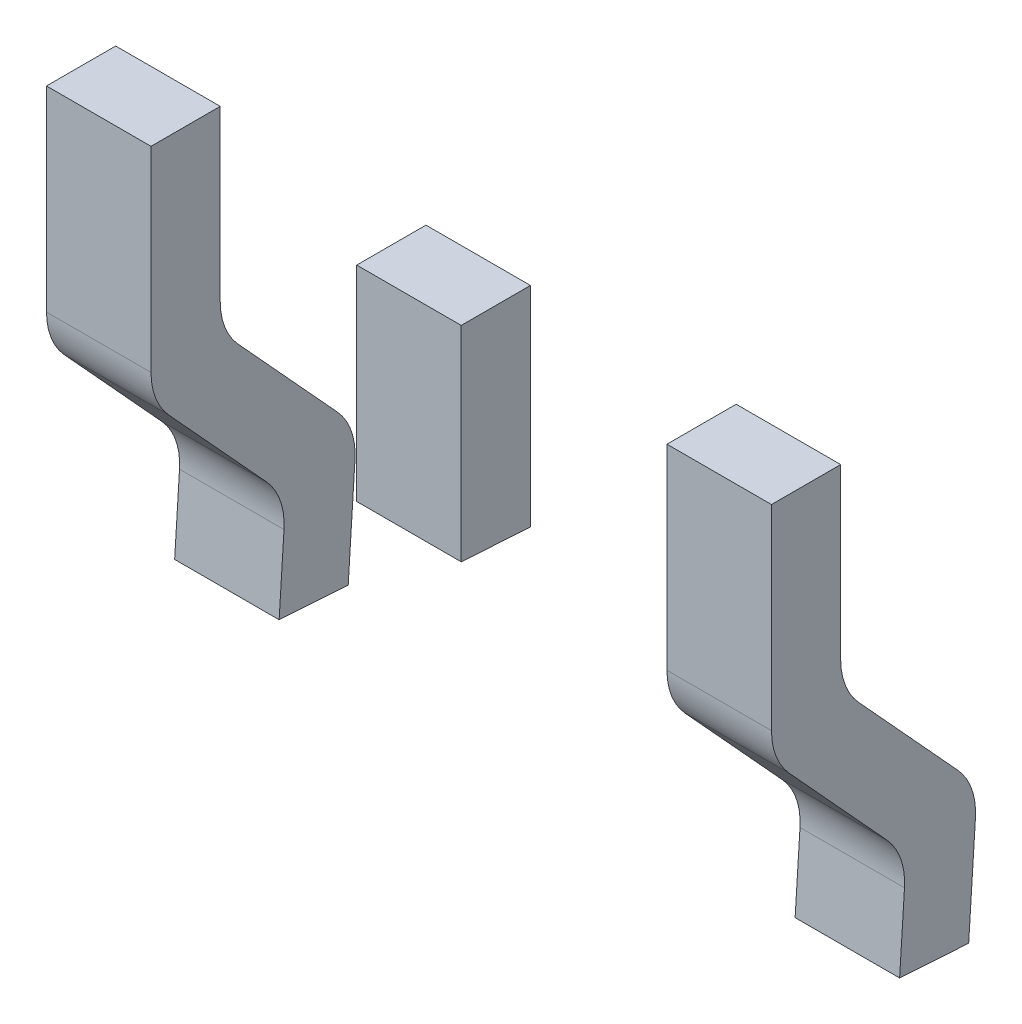
ISO-10303-21;
HEADER;
FILE_DESCRIPTION(('STEP AP214'),'2;1');
FILE_NAME('part.step','',(''),(''),'','','');
FILE_SCHEMA(('AUTOMOTIVE_DESIGN { 1 0 10303 214 1 1 1 1 }'));
ENDSEC;
DATA;
#1=APPLICATION_CONTEXT('core data for automotive mechanical design processes');
#2=APPLICATION_PROTOCOL_DEFINITION('international standard','automotive_design',2000,#1);
#3=PRODUCT_CONTEXT('',#1,'mechanical');
#4=PRODUCT('Part','Part','',(#3));
#5=PRODUCT_RELATED_PRODUCT_CATEGORY('part','',(#4));
#6=PRODUCT_DEFINITION_FORMATION('','',#4);
#7=PRODUCT_DEFINITION_CONTEXT('part definition',#1,'design');
#8=PRODUCT_DEFINITION('design','',#6,#7);
#9=PRODUCT_DEFINITION_SHAPE('','',#8);
#10=(LENGTH_UNIT() NAMED_UNIT(*) SI_UNIT(.MILLI.,.METRE.));
#11=(NAMED_UNIT(*) PLANE_ANGLE_UNIT() SI_UNIT($,.RADIAN.));
#12=(NAMED_UNIT(*) SI_UNIT($,.STERADIAN.) SOLID_ANGLE_UNIT());
#13=UNCERTAINTY_MEASURE_WITH_UNIT(LENGTH_MEASURE(1.E-05),#10,'distance_accuracy_value','');
#14=(GEOMETRIC_REPRESENTATION_CONTEXT(3) GLOBAL_UNCERTAINTY_ASSIGNED_CONTEXT((#13)) GLOBAL_UNIT_ASSIGNED_CONTEXT((#10,
#11,#12)) REPRESENTATION_CONTEXT('',''));
#15=CARTESIAN_POINT('',(0.,0.,0.));
#16=DIRECTION('',(0.,0.,1.));
#17=DIRECTION('',(1.,0.,0.));
#18=AXIS2_PLACEMENT_3D('',#15,#16,#17);
#19=CARTESIAN_POINT('',(-2.286,-3.883125111,1.02));
#20=DIRECTION('',(-1.,0.,0.));
#21=DIRECTION('',(0.,0.,-1.));
#22=AXIS2_PLACEMENT_3D('',#19,#20,#21);
#23=CYLINDRICAL_SURFACE('',#22,0.5);
#24=CARTESIAN_POINT('',(-1.901,-3.883125111,1.02));
#25=DIRECTION('',(-1.,0.,0.));
#26=DIRECTION('',(0.,0.,1.));
#27=AXIS2_PLACEMENT_3D('',#24,#25,#26);
#28=CIRCLE('',#27,0.5);
#29=CARTESIAN_POINT('',(-1.901,-4.220707572,1.388833407));
#30=VERTEX_POINT('',#29);
#31=CARTESIAN_POINT('',(-1.901,-3.883125111,1.52));
#32=VERTEX_POINT('',#31);
#33=EDGE_CURVE('P0_E255',#30,#32,#28,.T.);
#34=ORIENTED_EDGE('',*,*,#33,.T.);
#35=DIRECTION('',(-1.,0.,0.));
#36=VECTOR('',#35,1.);
#37=CARTESIAN_POINT('',(-1.901,-3.883125111,1.52));
#38=LINE('',#37,#36);
#39=CARTESIAN_POINT('',(-2.671,-3.883125111,1.52));
#40=VERTEX_POINT('',#39);
#41=EDGE_CURVE('P0_E47',#32,#40,#38,.T.);
#42=ORIENTED_EDGE('',*,*,#41,.T.);
#43=CARTESIAN_POINT('',(-2.671,-3.883125111,1.02));
#44=DIRECTION('',(1.,0.,0.));
#45=DIRECTION('',(0.,0.,-1.));
#46=AXIS2_PLACEMENT_3D('',#43,#44,#45);
#47=CIRCLE('',#46,0.5);
#48=CARTESIAN_POINT('',(-2.671,-4.220707572,1.388833407));
#49=VERTEX_POINT('',#48);
#50=EDGE_CURVE('P0_E38',#40,#49,#47,.T.);
#51=ORIENTED_EDGE('',*,*,#50,.T.);
#52=DIRECTION('',(1.,0.,0.));
#53=VECTOR('',#52,1.);
#54=CARTESIAN_POINT('',(-2.671,-4.220707572,1.388833407));
#55=LINE('',#54,#53);
#56=EDGE_CURVE('P0_E231',#49,#30,#55,.T.);
#57=ORIENTED_EDGE('',*,*,#56,.T.);
#58=EDGE_LOOP('',(#34,#42,#51,#57));
#59=FACE_BOUND('',#58,.T.);
#60=ADVANCED_FACE('P0_F17',(#59),#23,.T.);
#61=CARTESIAN_POINT('',(-2.286,-5.159538622,0.515992473));
#62=DIRECTION('',(1.,0.,0.));
#63=DIRECTION('',(0.,0.,1.));
#64=AXIS2_PLACEMENT_3D('',#61,#62,#63);
#65=CYLINDRICAL_SURFACE('',#64,0.5);
#66=CARTESIAN_POINT('',(-2.671,-5.159538622,0.515992473));
#67=DIRECTION('',(1.,0.,0.));
#68=DIRECTION('',(0.,0.,-1.));
#69=AXIS2_PLACEMENT_3D('',#66,#67,#68);
#70=CIRCLE('',#69,0.5);
#71=CARTESIAN_POINT('',(-2.671,-5.19163139,0.017023481));
#72=VERTEX_POINT('',#71);
#73=CARTESIAN_POINT('',(-2.671,-4.821956161,0.147159065));
#74=VERTEX_POINT('',#73);
#75=EDGE_CURVE('P0_E11',#72,#74,#70,.T.);
#76=ORIENTED_EDGE('',*,*,#75,.T.);
#77=DIRECTION('',(1.,0.,0.));
#78=VECTOR('',#77,1.);
#79=CARTESIAN_POINT('',(-2.671,-4.821956161,0.147159065));
#80=LINE('',#79,#78);
#81=CARTESIAN_POINT('',(-1.901,-4.821956161,0.147159065));
#82=VERTEX_POINT('',#81);
#83=EDGE_CURVE('P0_E214',#74,#82,#80,.T.);
#84=ORIENTED_EDGE('',*,*,#83,.T.);
#85=CARTESIAN_POINT('',(-1.901,-5.159538622,0.515992473));
#86=DIRECTION('',(-1.,0.,0.));
#87=DIRECTION('',(0.,0.,1.));
#88=AXIS2_PLACEMENT_3D('',#85,#86,#87);
#89=CIRCLE('',#88,0.5);
#90=CARTESIAN_POINT('',(-1.901,-5.19163139,0.017023481));
#91=VERTEX_POINT('',#90);
#92=EDGE_CURVE('P0_E259',#82,#91,#89,.T.);
#93=ORIENTED_EDGE('',*,*,#92,.T.);
#94=DIRECTION('',(-1.,0.,0.));
#95=VECTOR('',#94,1.);
#96=CARTESIAN_POINT('',(-1.901,-5.19163139,0.017023481));
#97=LINE('',#96,#95);
#98=EDGE_CURVE('P0_E146',#91,#72,#97,.T.);
#99=ORIENTED_EDGE('',*,*,#98,.T.);
#100=EDGE_LOOP('',(#76,#84,#93,#99));
#101=FACE_BOUND('',#100,.T.);
#102=ADVANCED_FACE('P0_F412',(#101),#65,.T.);
#103=CARTESIAN_POINT('',(-2.286,-5.343610965,1.038885469));
#104=DIRECTION('',(1.,0.,0.));
#105=DIRECTION('',(0.,0.,1.));
#106=AXIS2_PLACEMENT_3D('',#103,#104,#105);
#107=CYLINDRICAL_SURFACE('',#106,0.5);
#108=CARTESIAN_POINT('',(-1.901,-5.343610965,1.038885469));
#109=DIRECTION('',(1.,0.,0.));
#110=DIRECTION('',(0.,0.,1.));
#111=AXIS2_PLACEMENT_3D('',#108,#109,#110);
#112=CIRCLE('',#111,0.5);
#113=CARTESIAN_POINT('',(-1.901,-5.375703733,0.539916478));
#114=VERTEX_POINT('',#113);
#115=CARTESIAN_POINT('',(-1.901,-5.006028504,0.670052062));
#116=VERTEX_POINT('',#115);
#117=EDGE_CURVE('P0_E261',#114,#116,#112,.T.);
#118=ORIENTED_EDGE('',*,*,#117,.T.);
#119=DIRECTION('',(-1.,0.,0.));
#120=VECTOR('',#119,1.);
#121=CARTESIAN_POINT('',(-1.901,-5.006028504,0.670052062));
#122=LINE('',#121,#120);
#123=CARTESIAN_POINT('',(-2.671,-5.006028504,0.670052062));
#124=VERTEX_POINT('',#123);
#125=EDGE_CURVE('P0_E175',#116,#124,#122,.T.);
#126=ORIENTED_EDGE('',*,*,#125,.T.);
#127=CARTESIAN_POINT('',(-2.671,-5.343610965,1.038885469));
#128=DIRECTION('',(-1.,0.,0.));
#129=DIRECTION('',(0.,0.,-1.));
#130=AXIS2_PLACEMENT_3D('',#127,#128,#129);
#131=CIRCLE('',#130,0.5);
#132=CARTESIAN_POINT('',(-2.671,-5.375703733,0.539916478));
#133=VERTEX_POINT('',#132);
#134=EDGE_CURVE('P0_E248',#124,#133,#131,.T.);
#135=ORIENTED_EDGE('',*,*,#134,.T.);
#136=DIRECTION('',(1.,0.,0.));
#137=VECTOR('',#136,1.);
#138=CARTESIAN_POINT('',(-2.671,-5.375703733,0.539916478));
#139=LINE('',#138,#137);
#140=EDGE_CURVE('P0_E207',#133,#114,#139,.T.);
#141=ORIENTED_EDGE('',*,*,#140,.T.);
#142=EDGE_LOOP('',(#118,#126,#135,#141));
#143=FACE_BOUND('',#142,.T.);
#144=ADVANCED_FACE('P0_F273',(#143),#107,.F.);
#145=CARTESIAN_POINT('',(-2.286,-3.684966231,0.51));
#146=DIRECTION('',(-1.,0.,0.));
#147=DIRECTION('',(0.,0.,-1.));
#148=AXIS2_PLACEMENT_3D('',#145,#146,#147);
#149=CYLINDRICAL_SURFACE('',#148,0.5);
#150=CARTESIAN_POINT('',(-2.671,-3.684966231,0.51));
#151=DIRECTION('',(-1.,0.,0.));
#152=DIRECTION('',(0.,0.,-1.));
#153=AXIS2_PLACEMENT_3D('',#150,#151,#152);
#154=CIRCLE('',#153,0.5);
#155=CARTESIAN_POINT('',(-2.671,-4.022548692,0.878833407));
#156=VERTEX_POINT('',#155);
#157=CARTESIAN_POINT('',(-2.671,-3.684966231,1.01));
#158=VERTEX_POINT('',#157);
#159=EDGE_CURVE('P0_E20',#156,#158,#154,.T.);
#160=ORIENTED_EDGE('',*,*,#159,.T.);
#161=DIRECTION('',(1.,0.,0.));
#162=VECTOR('',#161,1.);
#163=CARTESIAN_POINT('',(-2.671,-3.684966231,1.01));
#164=LINE('',#163,#162);
#165=CARTESIAN_POINT('',(-1.901,-3.684966231,1.01));
#166=VERTEX_POINT('',#165);
#167=EDGE_CURVE('P0_E186',#158,#166,#164,.T.);
#168=ORIENTED_EDGE('',*,*,#167,.T.);
#169=CARTESIAN_POINT('',(-1.901,-3.684966231,0.51));
#170=DIRECTION('',(1.,0.,0.));
#171=DIRECTION('',(0.,0.,1.));
#172=AXIS2_PLACEMENT_3D('',#169,#170,#171);
#173=CIRCLE('',#172,0.5);
#174=CARTESIAN_POINT('',(-1.901,-4.022548692,0.878833407));
#175=VERTEX_POINT('',#174);
#176=EDGE_CURVE('P0_E245',#166,#175,#173,.T.);
#177=ORIENTED_EDGE('',*,*,#176,.T.);
#178=DIRECTION('',(-1.,0.,0.));
#179=VECTOR('',#178,1.);
#180=CARTESIAN_POINT('',(-1.901,-4.022548692,0.878833407));
#181=LINE('',#180,#179);
#182=EDGE_CURVE('P0_E223',#175,#156,#181,.T.);
#183=ORIENTED_EDGE('',*,*,#182,.T.);
#184=EDGE_LOOP('',(#160,#168,#177,#183));
#185=FACE_BOUND('',#184,.T.);
#186=ADVANCED_FACE('P0_F476',(#185),#149,.F.);
#187=CARTESIAN_POINT('',(-2.671,-3.05,1.265));
#188=DIRECTION('',(-1.,0.,0.));
#189=DIRECTION('',(0.,0.,1.));
#190=AXIS2_PLACEMENT_3D('',#187,#188,#189);
#191=PLANE('',#190);
#192=DIRECTION('',(0.,-0.997937982459945,0.0641855370295765));
#193=VECTOR('',#192,1.);
#194=CARTESIAN_POINT('',(-2.671,-5.19163139,0.017023481));
#195=LINE('',#194,#193);
#196=CARTESIAN_POINT('',(-2.671,-5.966282297,0.066847604));
#197=VERTEX_POINT('',#196);
#198=EDGE_CURVE('P0_E135',#72,#197,#195,.T.);
#199=ORIENTED_EDGE('',*,*,#198,.T.);
#200=DIRECTION('',(0.,0.0641855370295765,0.997937982459945));
#201=VECTOR('',#200,1.);
#202=CARTESIAN_POINT('',(-2.671,-5.966282297,0.066847604));
#203=LINE('',#202,#201);
#204=CARTESIAN_POINT('',(-2.671,-5.933547673,0.575795975));
#205=VERTEX_POINT('',#204);
#206=EDGE_CURVE('P0_E140',#197,#205,#203,.T.);
#207=ORIENTED_EDGE('',*,*,#206,.T.);
#208=DIRECTION('',(0.,-0.997937982459945,0.0641855370295765));
#209=VECTOR('',#208,1.);
#210=CARTESIAN_POINT('',(-2.671,-5.375703733,0.539916478));
#211=LINE('',#210,#209);
#212=EDGE_CURVE('P0_E181',#133,#205,#211,.T.);
#213=ORIENTED_EDGE('',*,*,#212,.F.);
#214=ORIENTED_EDGE('',*,*,#134,.F.);
#215=DIRECTION('',(0.,-0.737666814814986,-0.675164920830987));
#216=VECTOR('',#215,1.);
#217=CARTESIAN_POINT('',(-2.671,-4.220707572,1.388833407));
#218=LINE('',#217,#216);
#219=EDGE_CURVE('P0_E235',#49,#124,#218,.T.);
#220=ORIENTED_EDGE('',*,*,#219,.F.);
#221=ORIENTED_EDGE('',*,*,#50,.F.);
#222=DIRECTION('',(0.,-1.,0.));
#223=VECTOR('',#222,1.);
#224=CARTESIAN_POINT('',(-2.671,-2.44,1.52));
#225=LINE('',#224,#223);
#226=CARTESIAN_POINT('',(-2.671,-2.44,1.52));
#227=VERTEX_POINT('',#226);
#228=EDGE_CURVE('P0_E256',#227,#40,#225,.T.);
#229=ORIENTED_EDGE('',*,*,#228,.F.);
#230=DIRECTION('',(0.,0.,1.));
#231=VECTOR('',#230,1.);
#232=CARTESIAN_POINT('',(-2.671,-2.44,1.01));
#233=LINE('',#232,#231);
#234=CARTESIAN_POINT('',(-2.671,-2.44,1.01));
#235=VERTEX_POINT('',#234);
#236=EDGE_CURVE('P0_E191',#235,#227,#233,.T.);
#237=ORIENTED_EDGE('',*,*,#236,.F.);
#238=DIRECTION('',(0.,-1.,0.));
#239=VECTOR('',#238,1.);
#240=CARTESIAN_POINT('',(-2.671,-2.44,1.01));
#241=LINE('',#240,#239);
#242=EDGE_CURVE('P0_E171',#235,#158,#241,.T.);
#243=ORIENTED_EDGE('',*,*,#242,.T.);
#244=ORIENTED_EDGE('',*,*,#159,.F.);
#245=DIRECTION('',(0.,-0.737666814814986,-0.675164920830987));
#246=VECTOR('',#245,1.);
#247=CARTESIAN_POINT('',(-2.671,-4.022548692,0.878833407));
#248=LINE('',#247,#246);
#249=EDGE_CURVE('P0_E220',#156,#74,#248,.T.);
#250=ORIENTED_EDGE('',*,*,#249,.T.);
#251=ORIENTED_EDGE('',*,*,#75,.F.);
#252=EDGE_LOOP('',(#199,#207,#213,#214,#220,#221,#229,#237,#243,#244,#250,#251));
#253=FACE_BOUND('',#252,.T.);
#254=ADVANCED_FACE('P0_F137',(#253),#191,.T.);
#255=CARTESIAN_POINT('',(-2.286,-3.05,1.52));
#256=DIRECTION('',(0.,0.,1.));
#257=DIRECTION('',(1.,0.,0.));
#258=AXIS2_PLACEMENT_3D('',#255,#256,#257);
#259=PLANE('',#258);
#260=DIRECTION('',(0.,-1.,0.));
#261=VECTOR('',#260,1.);
#262=CARTESIAN_POINT('',(-1.901,-2.44,1.52));
#263=LINE('',#262,#261);
#264=CARTESIAN_POINT('',(-1.901,-2.44,1.52));
#265=VERTEX_POINT('',#264);
#266=EDGE_CURVE('P0_E251',#265,#32,#263,.T.);
#267=ORIENTED_EDGE('',*,*,#266,.F.);
#268=DIRECTION('',(1.,0.,0.));
#269=VECTOR('',#268,1.);
#270=CARTESIAN_POINT('',(-2.671,-2.44,1.52));
#271=LINE('',#270,#269);
#272=EDGE_CURVE('P0_E195',#227,#265,#271,.T.);
#273=ORIENTED_EDGE('',*,*,#272,.F.);
#274=ORIENTED_EDGE('',*,*,#228,.T.);
#275=ORIENTED_EDGE('',*,*,#41,.F.);
#276=EDGE_LOOP('',(#267,#273,#274,#275));
#277=FACE_BOUND('',#276,.T.);
#278=ADVANCED_FACE('P0_F461',(#277),#259,.T.);
#279=CARTESIAN_POINT('',(-1.901,-3.05,1.265));
#280=DIRECTION('',(1.,0.,0.));
#281=DIRECTION('',(0.,1.,0.));
#282=AXIS2_PLACEMENT_3D('',#279,#280,#281);
#283=PLANE('',#282);
#284=DIRECTION('',(0.,-0.737666814814986,-0.675164920830987));
#285=VECTOR('',#284,1.);
#286=CARTESIAN_POINT('',(-1.901,-4.022548692,0.878833407));
#287=LINE('',#286,#285);
#288=EDGE_CURVE('P0_E204',#175,#82,#287,.T.);
#289=ORIENTED_EDGE('',*,*,#288,.F.);
#290=ORIENTED_EDGE('',*,*,#176,.F.);
#291=DIRECTION('',(0.,-1.,0.));
#292=VECTOR('',#291,1.);
#293=CARTESIAN_POINT('',(-1.901,-2.44,1.01));
#294=LINE('',#293,#292);
#295=CARTESIAN_POINT('',(-1.901,-2.44,1.01));
#296=VERTEX_POINT('',#295);
#297=EDGE_CURVE('P0_E174',#296,#166,#294,.T.);
#298=ORIENTED_EDGE('',*,*,#297,.F.);
#299=DIRECTION('',(0.,0.,-1.));
#300=VECTOR('',#299,1.);
#301=CARTESIAN_POINT('',(-1.901,-2.44,1.52));
#302=LINE('',#301,#300);
#303=EDGE_CURVE('P0_E182',#265,#296,#302,.T.);
#304=ORIENTED_EDGE('',*,*,#303,.F.);
#305=ORIENTED_EDGE('',*,*,#266,.T.);
#306=ORIENTED_EDGE('',*,*,#33,.F.);
#307=DIRECTION('',(0.,-0.737666814814986,-0.675164920830987));
#308=VECTOR('',#307,1.);
#309=CARTESIAN_POINT('',(-1.901,-4.220707572,1.388833407));
#310=LINE('',#309,#308);
#311=EDGE_CURVE('P0_E227',#30,#116,#310,.T.);
#312=ORIENTED_EDGE('',*,*,#311,.T.);
#313=ORIENTED_EDGE('',*,*,#117,.F.);
#314=DIRECTION('',(0.,-0.997937982459945,0.0641855370295765));
#315=VECTOR('',#314,1.);
#316=CARTESIAN_POINT('',(-1.901,-5.375703733,0.539916478));
#317=LINE('',#316,#315);
#318=CARTESIAN_POINT('',(-1.901,-5.933547673,0.575795975));
#319=VERTEX_POINT('',#318);
#320=EDGE_CURVE('P0_E170',#114,#319,#317,.T.);
#321=ORIENTED_EDGE('',*,*,#320,.T.);
#322=DIRECTION('',(0.,-0.0641855370295765,-0.997937982459945));
#323=VECTOR('',#322,1.);
#324=CARTESIAN_POINT('',(-1.901,-5.933547673,0.575795975));
#325=LINE('',#324,#323);
#326=CARTESIAN_POINT('',(-1.901,-5.966282297,0.066847604));
#327=VERTEX_POINT('',#326);
#328=EDGE_CURVE('P0_E157',#319,#327,#325,.T.);
#329=ORIENTED_EDGE('',*,*,#328,.T.);
#330=DIRECTION('',(0.,-0.997937982459945,0.0641855370295765));
#331=VECTOR('',#330,1.);
#332=CARTESIAN_POINT('',(-1.901,-5.19163139,0.017023481));
#333=LINE('',#332,#331);
#334=EDGE_CURVE('P0_E147',#91,#327,#333,.T.);
#335=ORIENTED_EDGE('',*,*,#334,.F.);
#336=ORIENTED_EDGE('',*,*,#92,.F.);
#337=EDGE_LOOP('',(#289,#290,#298,#304,#305,#306,#312,#313,#321,#329,#335,#336));
#338=FACE_BOUND('',#337,.T.);
#339=ADVANCED_FACE('P0_F452',(#338),#283,.T.);
#340=CARTESIAN_POINT('',(-2.286,-3.05,1.01));
#341=DIRECTION('',(0.,0.,-1.));
#342=DIRECTION('',(0.,-1.,0.));
#343=AXIS2_PLACEMENT_3D('',#340,#341,#342);
#344=PLANE('',#343);
#345=ORIENTED_EDGE('',*,*,#242,.F.);
#346=DIRECTION('',(-1.,0.,0.));
#347=VECTOR('',#346,1.);
#348=CARTESIAN_POINT('',(-1.901,-2.44,1.01));
#349=LINE('',#348,#347);
#350=EDGE_CURVE('P0_E177',#296,#235,#349,.T.);
#351=ORIENTED_EDGE('',*,*,#350,.F.);
#352=ORIENTED_EDGE('',*,*,#297,.T.);
#353=ORIENTED_EDGE('',*,*,#167,.F.);
#354=EDGE_LOOP('',(#345,#351,#352,#353));
#355=FACE_BOUND('',#354,.T.);
#356=ADVANCED_FACE('P0_F443',(#355),#344,.T.);
#357=CARTESIAN_POINT('',(-2.286,-4.003332406,1.587790556));
#358=DIRECTION('',(0.,-0.675164920830987,0.737666814814986));
#359=DIRECTION('',(-1.,0.,0.));
#360=AXIS2_PLACEMENT_3D('',#357,#358,#359);
#361=PLANE('',#360);
#362=ORIENTED_EDGE('',*,*,#311,.F.);
#363=ORIENTED_EDGE('',*,*,#56,.F.);
#364=ORIENTED_EDGE('',*,*,#219,.T.);
#365=ORIENTED_EDGE('',*,*,#125,.F.);
#366=EDGE_LOOP('',(#362,#363,#364,#365));
#367=FACE_BOUND('',#366,.T.);
#368=ADVANCED_FACE('P0_F434',(#367),#361,.T.);
#369=CARTESIAN_POINT('',(-2.286,-3.658998297,1.211580481));
#370=DIRECTION('',(0.,0.675164920830987,-0.737666814814986));
#371=DIRECTION('',(-1.,0.,0.));
#372=AXIS2_PLACEMENT_3D('',#369,#370,#371);
#373=PLANE('',#372);
#374=ORIENTED_EDGE('',*,*,#288,.T.);
#375=ORIENTED_EDGE('',*,*,#83,.F.);
#376=ORIENTED_EDGE('',*,*,#249,.F.);
#377=ORIENTED_EDGE('',*,*,#182,.F.);
#378=EDGE_LOOP('',(#374,#375,#376,#377));
#379=FACE_BOUND('',#378,.T.);
#380=ADVANCED_FACE('P0_F426',(#379),#373,.T.);
#381=CARTESIAN_POINT('',(-2.286,-4.868497701,-0.003759884));
#382=DIRECTION('',(0.,-0.0641855370295765,-0.997937982459945));
#383=DIRECTION('',(0.,-0.997937982459945,0.0641855370295765));
#384=AXIS2_PLACEMENT_3D('',#381,#382,#383);
#385=PLANE('',#384);
#386=ORIENTED_EDGE('',*,*,#334,.T.);
#387=DIRECTION('',(-1.,0.,0.));
#388=VECTOR('',#387,1.);
#389=CARTESIAN_POINT('',(-1.901,-5.966282297,0.066847604));
#390=LINE('',#389,#388);
#391=EDGE_CURVE('P0_E150',#327,#197,#390,.T.);
#392=ORIENTED_EDGE('',*,*,#391,.T.);
#393=ORIENTED_EDGE('',*,*,#198,.F.);
#394=ORIENTED_EDGE('',*,*,#98,.F.);
#395=EDGE_LOOP('',(#386,#392,#393,#394));
#396=FACE_BOUND('',#395,.T.);
#397=ADVANCED_FACE('P0_F151',(#396),#385,.T.);
#398=CARTESIAN_POINT('',(-2.286,-4.835763077,0.505188487));
#399=DIRECTION('',(0.,0.0641855370295765,0.997937982459945));
#400=DIRECTION('',(1.,0.,0.));
#401=AXIS2_PLACEMENT_3D('',#398,#399,#400);
#402=PLANE('',#401);
#403=ORIENTED_EDGE('',*,*,#212,.T.);
#404=DIRECTION('',(1.,0.,0.));
#405=VECTOR('',#404,1.);
#406=CARTESIAN_POINT('',(-2.671,-5.933547673,0.575795975));
#407=LINE('',#406,#405);
#408=EDGE_CURVE('P0_E162',#205,#319,#407,.T.);
#409=ORIENTED_EDGE('',*,*,#408,.T.);
#410=ORIENTED_EDGE('',*,*,#320,.F.);
#411=ORIENTED_EDGE('',*,*,#140,.F.);
#412=EDGE_LOOP('',(#403,#409,#410,#411));
#413=FACE_BOUND('',#412,.T.);
#414=ADVANCED_FACE('P0_F277',(#413),#402,.T.);
#415=CARTESIAN_POINT('',(-2.286,-2.44,0.));
#416=DIRECTION('',(0.,-1.,0.));
#417=DIRECTION('',(0.,0.,-1.));
#418=AXIS2_PLACEMENT_3D('',#415,#416,#417);
#419=PLANE('',#418);
#420=ORIENTED_EDGE('',*,*,#236,.T.);
#421=ORIENTED_EDGE('',*,*,#272,.T.);
#422=ORIENTED_EDGE('',*,*,#303,.T.);
#423=ORIENTED_EDGE('',*,*,#350,.T.);
#424=EDGE_LOOP('',(#420,#421,#422,#423));
#425=FACE_BOUND('',#424,.T.);
#426=ADVANCED_FACE('P0_F393',(#425),#419,.F.);
#427=CARTESIAN_POINT('',(-2.286,-6.031109689,-0.941069759));
#428=DIRECTION('',(0.,-0.997937982459945,0.0641855370295765));
#429=DIRECTION('',(-1.,0.,0.));
#430=AXIS2_PLACEMENT_3D('',#427,#428,#429);
#431=PLANE('',#430);
#432=ORIENTED_EDGE('',*,*,#206,.F.);
#433=ORIENTED_EDGE('',*,*,#391,.F.);
#434=ORIENTED_EDGE('',*,*,#328,.F.);
#435=ORIENTED_EDGE('',*,*,#408,.F.);
#436=EDGE_LOOP('',(#432,#433,#434,#435));
#437=FACE_BOUND('',#436,.T.);
#438=ADVANCED_FACE('P0_F160',(#437),#431,.T.);
#439=CLOSED_SHELL('',(#60,#102,#144,#186,#254,#278,#339,#356,#368,#380,#397,#414,#426,#438));
#440=MANIFOLD_SOLID_BREP('P0_B1',#439);
#441=CARTESIAN_POINT('',(2.286,-3.883125111,1.02));
#442=DIRECTION('',(1.,0.,0.));
#443=DIRECTION('',(0.,0.,-1.));
#444=AXIS2_PLACEMENT_3D('',#441,#442,#443);
#445=CYLINDRICAL_SURFACE('',#444,0.5);
#446=CARTESIAN_POINT('',(1.901,-3.883125111,1.02));
#447=DIRECTION('',(-1.,0.,0.));
#448=DIRECTION('',(0.,0.,1.));
#449=AXIS2_PLACEMENT_3D('',#446,#447,#448);
#450=CIRCLE('',#449,0.5);
#451=CARTESIAN_POINT('',(1.901,-4.220707572,1.388833407));
#452=VERTEX_POINT('',#451);
#453=CARTESIAN_POINT('',(1.901,-3.883125111,1.52));
#454=VERTEX_POINT('',#453);
#455=EDGE_CURVE('P1_E144',#452,#454,#450,.T.);
#456=ORIENTED_EDGE('',*,*,#455,.F.);
#457=DIRECTION('',(-1.,0.,0.));
#458=VECTOR('',#457,1.);
#459=CARTESIAN_POINT('',(2.671,-4.220707572,1.388833407));
#460=LINE('',#459,#458);
#461=CARTESIAN_POINT('',(2.671,-4.220707572,1.388833407));
#462=VERTEX_POINT('',#461);
#463=EDGE_CURVE('P1_E242',#462,#452,#460,.T.);
#464=ORIENTED_EDGE('',*,*,#463,.F.);
#465=CARTESIAN_POINT('',(2.671,-3.883125111,1.02));
#466=DIRECTION('',(1.,0.,0.));
#467=DIRECTION('',(0.,0.,-1.));
#468=AXIS2_PLACEMENT_3D('',#465,#466,#467);
#469=CIRCLE('',#468,0.5);
#470=CARTESIAN_POINT('',(2.671,-3.883125111,1.52));
#471=VERTEX_POINT('',#470);
#472=EDGE_CURVE('P1_E21',#471,#462,#469,.T.);
#473=ORIENTED_EDGE('',*,*,#472,.F.);
#474=DIRECTION('',(1.,0.,0.));
#475=VECTOR('',#474,1.);
#476=CARTESIAN_POINT('',(1.901,-3.883125111,1.52));
#477=LINE('',#476,#475);
#478=EDGE_CURVE('P1_E45',#454,#471,#477,.T.);
#479=ORIENTED_EDGE('',*,*,#478,.F.);
#480=EDGE_LOOP('',(#456,#464,#473,#479));
#481=FACE_BOUND('',#480,.T.);
#482=ADVANCED_FACE('P1_F17',(#481),#445,.T.);
#483=CARTESIAN_POINT('',(2.286,-5.159538622,0.515992473));
#484=DIRECTION('',(-1.,0.,0.));
#485=DIRECTION('',(0.,0.,1.));
#486=AXIS2_PLACEMENT_3D('',#483,#484,#485);
#487=CYLINDRICAL_SURFACE('',#486,0.5);
#488=CARTESIAN_POINT('',(2.671,-5.159538622,0.515992473));
#489=DIRECTION('',(1.,0.,0.));
#490=DIRECTION('',(0.,0.,-1.));
#491=AXIS2_PLACEMENT_3D('',#488,#489,#490);
#492=CIRCLE('',#491,0.5);
#493=CARTESIAN_POINT('',(2.671,-5.19163139,0.017023481));
#494=VERTEX_POINT('',#493);
#495=CARTESIAN_POINT('',(2.671,-4.821956161,0.147159065));
#496=VERTEX_POINT('',#495);
#497=EDGE_CURVE('P1_E196',#494,#496,#492,.T.);
#498=ORIENTED_EDGE('',*,*,#497,.F.);
#499=DIRECTION('',(1.,0.,0.));
#500=VECTOR('',#499,1.);
#501=CARTESIAN_POINT('',(1.901,-5.19163139,0.017023481));
#502=LINE('',#501,#500);
#503=CARTESIAN_POINT('',(1.901,-5.19163139,0.017023481));
#504=VERTEX_POINT('',#503);
#505=EDGE_CURVE('P1_E208',#504,#494,#502,.T.);
#506=ORIENTED_EDGE('',*,*,#505,.F.);
#507=CARTESIAN_POINT('',(1.901,-5.159538622,0.515992473));
#508=DIRECTION('',(-1.,0.,0.));
#509=DIRECTION('',(0.,0.,1.));
#510=AXIS2_PLACEMENT_3D('',#507,#508,#509);
#511=CIRCLE('',#510,0.5);
#512=CARTESIAN_POINT('',(1.901,-4.821956161,0.147159065));
#513=VERTEX_POINT('',#512);
#514=EDGE_CURVE('P1_E188',#513,#504,#511,.T.);
#515=ORIENTED_EDGE('',*,*,#514,.F.);
#516=DIRECTION('',(-1.,0.,0.));
#517=VECTOR('',#516,1.);
#518=CARTESIAN_POINT('',(2.671,-4.821956161,0.147159065));
#519=LINE('',#518,#517);
#520=EDGE_CURVE('P1_E204',#496,#513,#519,.T.);
#521=ORIENTED_EDGE('',*,*,#520,.F.);
#522=EDGE_LOOP('',(#498,#506,#515,#521));
#523=FACE_BOUND('',#522,.T.);
#524=ADVANCED_FACE('P1_F19',(#523),#487,.T.);
#525=CARTESIAN_POINT('',(2.286,-5.343610965,1.038885469));
#526=DIRECTION('',(-1.,0.,0.));
#527=DIRECTION('',(0.,0.,1.));
#528=AXIS2_PLACEMENT_3D('',#525,#526,#527);
#529=CYLINDRICAL_SURFACE('',#528,0.5);
#530=CARTESIAN_POINT('',(1.901,-5.343610965,1.038885469));
#531=DIRECTION('',(1.,0.,0.));
#532=DIRECTION('',(0.,0.,1.));
#533=AXIS2_PLACEMENT_3D('',#530,#531,#532);
#534=CIRCLE('',#533,0.5);
#535=CARTESIAN_POINT('',(1.901,-5.375703733,0.539916478));
#536=VERTEX_POINT('',#535);
#537=CARTESIAN_POINT('',(1.901,-5.006028504,0.670052062));
#538=VERTEX_POINT('',#537);
#539=EDGE_CURVE('P1_E185',#536,#538,#534,.T.);
#540=ORIENTED_EDGE('',*,*,#539,.F.);
#541=DIRECTION('',(-1.,0.,0.));
#542=VECTOR('',#541,1.);
#543=CARTESIAN_POINT('',(2.671,-5.375703733,0.539916478));
#544=LINE('',#543,#542);
#545=CARTESIAN_POINT('',(2.671,-5.375703733,0.539916478));
#546=VERTEX_POINT('',#545);
#547=EDGE_CURVE('P1_E193',#546,#536,#544,.T.);
#548=ORIENTED_EDGE('',*,*,#547,.F.);
#549=CARTESIAN_POINT('',(2.671,-5.343610965,1.038885469));
#550=DIRECTION('',(-1.,0.,0.));
#551=DIRECTION('',(0.,0.,-1.));
#552=AXIS2_PLACEMENT_3D('',#549,#550,#551);
#553=CIRCLE('',#552,0.5);
#554=CARTESIAN_POINT('',(2.671,-5.006028504,0.670052062));
#555=VERTEX_POINT('',#554);
#556=EDGE_CURVE('P1_E11',#555,#546,#553,.T.);
#557=ORIENTED_EDGE('',*,*,#556,.F.);
#558=DIRECTION('',(1.,0.,0.));
#559=VECTOR('',#558,1.);
#560=CARTESIAN_POINT('',(1.901,-5.006028504,0.670052062));
#561=LINE('',#560,#559);
#562=EDGE_CURVE('P1_E234',#538,#555,#561,.T.);
#563=ORIENTED_EDGE('',*,*,#562,.F.);
#564=EDGE_LOOP('',(#540,#548,#557,#563));
#565=FACE_BOUND('',#564,.T.);
#566=ADVANCED_FACE('P1_F281',(#565),#529,.F.);
#567=CARTESIAN_POINT('',(2.286,-3.684966231,0.51));
#568=DIRECTION('',(1.,0.,0.));
#569=DIRECTION('',(0.,0.,-1.));
#570=AXIS2_PLACEMENT_3D('',#567,#568,#569);
#571=CYLINDRICAL_SURFACE('',#570,0.5);
#572=CARTESIAN_POINT('',(2.671,-3.684966231,0.51));
#573=DIRECTION('',(-1.,0.,0.));
#574=DIRECTION('',(0.,0.,-1.));
#575=AXIS2_PLACEMENT_3D('',#572,#573,#574);
#576=CIRCLE('',#575,0.5);
#577=CARTESIAN_POINT('',(2.671,-4.022548692,0.878833407));
#578=VERTEX_POINT('',#577);
#579=CARTESIAN_POINT('',(2.671,-3.684966231,1.01));
#580=VERTEX_POINT('',#579);
#581=EDGE_CURVE('P1_E264',#578,#580,#576,.T.);
#582=ORIENTED_EDGE('',*,*,#581,.F.);
#583=DIRECTION('',(1.,0.,0.));
#584=VECTOR('',#583,1.);
#585=CARTESIAN_POINT('',(1.901,-4.022548692,0.878833407));
#586=LINE('',#585,#584);
#587=CARTESIAN_POINT('',(1.901,-4.022548692,0.878833407));
#588=VERTEX_POINT('',#587);
#589=EDGE_CURVE('P1_E205',#588,#578,#586,.T.);
#590=ORIENTED_EDGE('',*,*,#589,.F.);
#591=CARTESIAN_POINT('',(1.901,-3.684966231,0.51));
#592=DIRECTION('',(1.,0.,0.));
#593=DIRECTION('',(0.,0.,1.));
#594=AXIS2_PLACEMENT_3D('',#591,#592,#593);
#595=CIRCLE('',#594,0.5);
#596=CARTESIAN_POINT('',(1.901,-3.684966231,1.01));
#597=VERTEX_POINT('',#596);
#598=EDGE_CURVE('P1_E147',#597,#588,#595,.T.);
#599=ORIENTED_EDGE('',*,*,#598,.F.);
#600=DIRECTION('',(-1.,0.,0.));
#601=VECTOR('',#600,1.);
#602=CARTESIAN_POINT('',(2.671,-3.684966231,1.01));
#603=LINE('',#602,#601);
#604=EDGE_CURVE('P1_E250',#580,#597,#603,.T.);
#605=ORIENTED_EDGE('',*,*,#604,.F.);
#606=EDGE_LOOP('',(#582,#590,#599,#605));
#607=FACE_BOUND('',#606,.T.);
#608=ADVANCED_FACE('P1_F470',(#607),#571,.F.);
#609=CARTESIAN_POINT('',(2.671,-3.05,1.265));
#610=DIRECTION('',(1.,0.,0.));
#611=DIRECTION('',(0.,1.,0.));
#612=AXIS2_PLACEMENT_3D('',#609,#610,#611);
#613=PLANE('',#612);
#614=DIRECTION('',(0.,-0.997937982459945,0.0641855370295765));
#615=VECTOR('',#614,1.);
#616=CARTESIAN_POINT('',(2.671,-5.19163139,0.017023481));
#617=LINE('',#616,#615);
#618=CARTESIAN_POINT('',(2.671,-5.966282297,0.066847604));
#619=VERTEX_POINT('',#618);
#620=EDGE_CURVE('P1_E215',#494,#619,#617,.T.);
#621=ORIENTED_EDGE('',*,*,#620,.F.);
#622=ORIENTED_EDGE('',*,*,#497,.T.);
#623=DIRECTION('',(0.,-0.737666814814986,-0.675164920830987));
#624=VECTOR('',#623,1.);
#625=CARTESIAN_POINT('',(2.671,-4.022548692,0.878833407));
#626=LINE('',#625,#624);
#627=EDGE_CURVE('P1_E201',#578,#496,#626,.T.);
#628=ORIENTED_EDGE('',*,*,#627,.F.);
#629=ORIENTED_EDGE('',*,*,#581,.T.);
#630=DIRECTION('',(0.,-1.,0.));
#631=VECTOR('',#630,1.);
#632=CARTESIAN_POINT('',(2.671,-2.44,1.01));
#633=LINE('',#632,#631);
#634=CARTESIAN_POINT('',(2.671,-2.44,1.01));
#635=VERTEX_POINT('',#634);
#636=EDGE_CURVE('P1_E246',#635,#580,#633,.T.);
#637=ORIENTED_EDGE('',*,*,#636,.F.);
#638=DIRECTION('',(0.,0.,1.));
#639=VECTOR('',#638,1.);
#640=CARTESIAN_POINT('',(2.671,-2.44,1.01));
#641=LINE('',#640,#639);
#642=CARTESIAN_POINT('',(2.671,-2.44,1.52));
#643=VERTEX_POINT('',#642);
#644=EDGE_CURVE('P1_E168',#635,#643,#641,.T.);
#645=ORIENTED_EDGE('',*,*,#644,.T.);
#646=DIRECTION('',(0.,-1.,0.));
#647=VECTOR('',#646,1.);
#648=CARTESIAN_POINT('',(2.671,-2.44,1.52));
#649=LINE('',#648,#647);
#650=EDGE_CURVE('P1_E152',#643,#471,#649,.T.);
#651=ORIENTED_EDGE('',*,*,#650,.T.);
#652=ORIENTED_EDGE('',*,*,#472,.T.);
#653=DIRECTION('',(0.,-0.737666814814986,-0.675164920830987));
#654=VECTOR('',#653,1.);
#655=CARTESIAN_POINT('',(2.671,-4.220707572,1.388833407));
#656=LINE('',#655,#654);
#657=EDGE_CURVE('P1_E238',#462,#555,#656,.T.);
#658=ORIENTED_EDGE('',*,*,#657,.T.);
#659=ORIENTED_EDGE('',*,*,#556,.T.);
#660=DIRECTION('',(0.,-0.997937982459945,0.0641855370295765));
#661=VECTOR('',#660,1.);
#662=CARTESIAN_POINT('',(2.671,-5.375703733,0.539916478));
#663=LINE('',#662,#661);
#664=CARTESIAN_POINT('',(2.671,-5.933547673,0.575795975));
#665=VERTEX_POINT('',#664);
#666=EDGE_CURVE('P1_E157',#546,#665,#663,.T.);
#667=ORIENTED_EDGE('',*,*,#666,.T.);
#668=DIRECTION('',(0.,0.0641855370295765,0.997937982459945));
#669=VECTOR('',#668,1.);
#670=CARTESIAN_POINT('',(2.671,-5.966282297,0.066847604));
#671=LINE('',#670,#669);
#672=EDGE_CURVE('P1_E172',#619,#665,#671,.T.);
#673=ORIENTED_EDGE('',*,*,#672,.F.);
#674=EDGE_LOOP('',(#621,#622,#628,#629,#637,#645,#651,#652,#658,#659,#667,#673));
#675=FACE_BOUND('',#674,.T.);
#676=ADVANCED_FACE('P1_F275',(#675),#613,.T.);
#677=CARTESIAN_POINT('',(2.286,-3.05,1.52));
#678=DIRECTION('',(0.,0.,1.));
#679=DIRECTION('',(1.,0.,0.));
#680=AXIS2_PLACEMENT_3D('',#677,#678,#679);
#681=PLANE('',#680);
#682=DIRECTION('',(0.,-1.,0.));
#683=VECTOR('',#682,1.);
#684=CARTESIAN_POINT('',(1.901,-2.44,1.52));
#685=LINE('',#684,#683);
#686=CARTESIAN_POINT('',(1.901,-2.44,1.52));
#687=VERTEX_POINT('',#686);
#688=EDGE_CURVE('P1_E135',#687,#454,#685,.T.);
#689=ORIENTED_EDGE('',*,*,#688,.T.);
#690=ORIENTED_EDGE('',*,*,#478,.T.);
#691=ORIENTED_EDGE('',*,*,#650,.F.);
#692=DIRECTION('',(-1.,0.,0.));
#693=VECTOR('',#692,1.);
#694=CARTESIAN_POINT('',(2.671,-2.44,1.52));
#695=LINE('',#694,#693);
#696=EDGE_CURVE('P1_E150',#643,#687,#695,.T.);
#697=ORIENTED_EDGE('',*,*,#696,.T.);
#698=EDGE_LOOP('',(#689,#690,#691,#697));
#699=FACE_BOUND('',#698,.T.);
#700=ADVANCED_FACE('P1_F151',(#699),#681,.T.);
#701=CARTESIAN_POINT('',(1.901,-3.05,1.265));
#702=DIRECTION('',(-1.,0.,0.));
#703=DIRECTION('',(0.,0.,1.));
#704=AXIS2_PLACEMENT_3D('',#701,#702,#703);
#705=PLANE('',#704);
#706=DIRECTION('',(0.,-0.737666814814986,-0.675164920830987));
#707=VECTOR('',#706,1.);
#708=CARTESIAN_POINT('',(1.901,-4.022548692,0.878833407));
#709=LINE('',#708,#707);
#710=EDGE_CURVE('P1_E221',#588,#513,#709,.T.);
#711=ORIENTED_EDGE('',*,*,#710,.T.);
#712=ORIENTED_EDGE('',*,*,#514,.T.);
#713=DIRECTION('',(0.,-0.997937982459945,0.0641855370295765));
#714=VECTOR('',#713,1.);
#715=CARTESIAN_POINT('',(1.901,-5.19163139,0.017023481));
#716=LINE('',#715,#714);
#717=CARTESIAN_POINT('',(1.901,-5.966282297,0.066847604));
#718=VERTEX_POINT('',#717);
#719=EDGE_CURVE('P1_E192',#504,#718,#716,.T.);
#720=ORIENTED_EDGE('',*,*,#719,.T.);
#721=DIRECTION('',(0.,-0.0641855370295765,-0.997937982459945));
#722=VECTOR('',#721,1.);
#723=CARTESIAN_POINT('',(1.901,-5.933547673,0.575795975));
#724=LINE('',#723,#722);
#725=CARTESIAN_POINT('',(1.901,-5.933547673,0.575795975));
#726=VERTEX_POINT('',#725);
#727=EDGE_CURVE('P1_E177',#726,#718,#724,.T.);
#728=ORIENTED_EDGE('',*,*,#727,.F.);
#729=DIRECTION('',(0.,-0.997937982459945,0.0641855370295765));
#730=VECTOR('',#729,1.);
#731=CARTESIAN_POINT('',(1.901,-5.375703733,0.539916478));
#732=LINE('',#731,#730);
#733=EDGE_CURVE('P1_E189',#536,#726,#732,.T.);
#734=ORIENTED_EDGE('',*,*,#733,.F.);
#735=ORIENTED_EDGE('',*,*,#539,.T.);
#736=DIRECTION('',(0.,-0.737666814814986,-0.675164920830987));
#737=VECTOR('',#736,1.);
#738=CARTESIAN_POINT('',(1.901,-4.220707572,1.388833407));
#739=LINE('',#738,#737);
#740=EDGE_CURVE('P1_E230',#452,#538,#739,.T.);
#741=ORIENTED_EDGE('',*,*,#740,.F.);
#742=ORIENTED_EDGE('',*,*,#455,.T.);
#743=ORIENTED_EDGE('',*,*,#688,.F.);
#744=DIRECTION('',(0.,0.,-1.));
#745=VECTOR('',#744,1.);
#746=CARTESIAN_POINT('',(1.901,-2.44,1.52));
#747=LINE('',#746,#745);
#748=CARTESIAN_POINT('',(1.901,-2.44,1.01));
#749=VERTEX_POINT('',#748);
#750=EDGE_CURVE('P1_E141',#687,#749,#747,.T.);
#751=ORIENTED_EDGE('',*,*,#750,.T.);
#752=DIRECTION('',(0.,-1.,0.));
#753=VECTOR('',#752,1.);
#754=CARTESIAN_POINT('',(1.901,-2.44,1.01));
#755=LINE('',#754,#753);
#756=EDGE_CURVE('P1_E254',#749,#597,#755,.T.);
#757=ORIENTED_EDGE('',*,*,#756,.T.);
#758=ORIENTED_EDGE('',*,*,#598,.T.);
#759=EDGE_LOOP('',(#711,#712,#720,#728,#734,#735,#741,#742,#743,#751,#757,#758));
#760=FACE_BOUND('',#759,.T.);
#761=ADVANCED_FACE('P1_F138',(#760),#705,.T.);
#762=CARTESIAN_POINT('',(2.286,-3.05,1.01));
#763=DIRECTION('',(0.,0.,-1.));
#764=DIRECTION('',(0.,-1.,0.));
#765=AXIS2_PLACEMENT_3D('',#762,#763,#764);
#766=PLANE('',#765);
#767=ORIENTED_EDGE('',*,*,#636,.T.);
#768=ORIENTED_EDGE('',*,*,#604,.T.);
#769=ORIENTED_EDGE('',*,*,#756,.F.);
#770=DIRECTION('',(1.,0.,0.));
#771=VECTOR('',#770,1.);
#772=CARTESIAN_POINT('',(1.901,-2.44,1.01));
#773=LINE('',#772,#771);
#774=EDGE_CURVE('P1_E161',#749,#635,#773,.T.);
#775=ORIENTED_EDGE('',*,*,#774,.T.);
#776=EDGE_LOOP('',(#767,#768,#769,#775));
#777=FACE_BOUND('',#776,.T.);
#778=ADVANCED_FACE('P1_F419',(#777),#766,.T.);
#779=CARTESIAN_POINT('',(2.286,-4.003332406,1.587790556));
#780=DIRECTION('',(0.,-0.675164920830987,0.737666814814986));
#781=DIRECTION('',(-1.,0.,0.));
#782=AXIS2_PLACEMENT_3D('',#779,#780,#781);
#783=PLANE('',#782);
#784=ORIENTED_EDGE('',*,*,#740,.T.);
#785=ORIENTED_EDGE('',*,*,#562,.T.);
#786=ORIENTED_EDGE('',*,*,#657,.F.);
#787=ORIENTED_EDGE('',*,*,#463,.T.);
#788=EDGE_LOOP('',(#784,#785,#786,#787));
#789=FACE_BOUND('',#788,.T.);
#790=ADVANCED_FACE('P1_F278',(#789),#783,.T.);
#791=CARTESIAN_POINT('',(2.286,-3.658998297,1.211580481));
#792=DIRECTION('',(0.,0.675164920830987,-0.737666814814986));
#793=DIRECTION('',(-1.,0.,0.));
#794=AXIS2_PLACEMENT_3D('',#791,#792,#793);
#795=PLANE('',#794);
#796=ORIENTED_EDGE('',*,*,#710,.F.);
#797=ORIENTED_EDGE('',*,*,#589,.T.);
#798=ORIENTED_EDGE('',*,*,#627,.T.);
#799=ORIENTED_EDGE('',*,*,#520,.T.);
#800=EDGE_LOOP('',(#796,#797,#798,#799));
#801=FACE_BOUND('',#800,.T.);
#802=ADVANCED_FACE('P1_F397',(#801),#795,.T.);
#803=CARTESIAN_POINT('',(2.286,-4.868497701,-0.003759884));
#804=DIRECTION('',(0.,-0.0641855370295765,-0.997937982459945));
#805=DIRECTION('',(0.,-0.997937982459945,0.0641855370295765));
#806=AXIS2_PLACEMENT_3D('',#803,#804,#805);
#807=PLANE('',#806);
#808=ORIENTED_EDGE('',*,*,#719,.F.);
#809=ORIENTED_EDGE('',*,*,#505,.T.);
#810=ORIENTED_EDGE('',*,*,#620,.T.);
#811=DIRECTION('',(1.,0.,0.));
#812=VECTOR('',#811,1.);
#813=CARTESIAN_POINT('',(1.901,-5.966282297,0.066847604));
#814=LINE('',#813,#812);
#815=EDGE_CURVE('P1_E178',#718,#619,#814,.T.);
#816=ORIENTED_EDGE('',*,*,#815,.F.);
#817=EDGE_LOOP('',(#808,#809,#810,#816));
#818=FACE_BOUND('',#817,.T.);
#819=ADVANCED_FACE('P1_F402',(#818),#807,.T.);
#820=CARTESIAN_POINT('',(2.286,-4.835763077,0.505188487));
#821=DIRECTION('',(0.,0.0641855370295765,0.997937982459945));
#822=DIRECTION('',(1.,0.,0.));
#823=AXIS2_PLACEMENT_3D('',#820,#821,#822);
#824=PLANE('',#823);
#825=ORIENTED_EDGE('',*,*,#666,.F.);
#826=ORIENTED_EDGE('',*,*,#547,.T.);
#827=ORIENTED_EDGE('',*,*,#733,.T.);
#828=DIRECTION('',(-1.,0.,0.));
#829=VECTOR('',#828,1.);
#830=CARTESIAN_POINT('',(2.671,-5.933547673,0.575795975));
#831=LINE('',#830,#829);
#832=EDGE_CURVE('P1_E173',#665,#726,#831,.T.);
#833=ORIENTED_EDGE('',*,*,#832,.F.);
#834=EDGE_LOOP('',(#825,#826,#827,#833));
#835=FACE_BOUND('',#834,.T.);
#836=ADVANCED_FACE('P1_F289',(#835),#824,.T.);
#837=CARTESIAN_POINT('',(2.286,-2.44,0.));
#838=DIRECTION('',(0.,-1.,0.));
#839=DIRECTION('',(0.,0.,-1.));
#840=AXIS2_PLACEMENT_3D('',#837,#838,#839);
#841=PLANE('',#840);
#842=ORIENTED_EDGE('',*,*,#644,.F.);
#843=ORIENTED_EDGE('',*,*,#774,.F.);
#844=ORIENTED_EDGE('',*,*,#750,.F.);
#845=ORIENTED_EDGE('',*,*,#696,.F.);
#846=EDGE_LOOP('',(#842,#843,#844,#845));
#847=FACE_BOUND('',#846,.T.);
#848=ADVANCED_FACE('P1_F159',(#847),#841,.F.);
#849=CARTESIAN_POINT('',(2.286,-6.031109689,-0.941069759));
#850=DIRECTION('',(0.,-0.997937982459945,0.0641855370295765));
#851=DIRECTION('',(-1.,0.,0.));
#852=AXIS2_PLACEMENT_3D('',#849,#850,#851);
#853=PLANE('',#852);
#854=ORIENTED_EDGE('',*,*,#672,.T.);
#855=ORIENTED_EDGE('',*,*,#832,.T.);
#856=ORIENTED_EDGE('',*,*,#727,.T.);
#857=ORIENTED_EDGE('',*,*,#815,.T.);
#858=EDGE_LOOP('',(#854,#855,#856,#857));
#859=FACE_BOUND('',#858,.T.);
#860=ADVANCED_FACE('P1_F292',(#859),#853,.T.);
#861=CLOSED_SHELL('',(#482,#524,#566,#608,#676,#700,#761,#778,#790,#802,#819,#836,#848,#860));
#862=MANIFOLD_SOLID_BREP('P1_B1',#861);
#863=CARTESIAN_POINT('',(0.,-3.05,1.52));
#864=DIRECTION('',(0.,0.,1.));
#865=DIRECTION('',(1.,0.,0.));
#866=AXIS2_PLACEMENT_3D('',#863,#864,#865);
#867=PLANE('',#866);
#868=DIRECTION('',(0.,-1.,0.));
#869=VECTOR('',#868,1.);
#870=CARTESIAN_POINT('',(-0.385,-2.44,1.52));
#871=LINE('',#870,#869);
#872=CARTESIAN_POINT('',(-0.385,-2.44,1.52));
#873=VERTEX_POINT('',#872);
#874=CARTESIAN_POINT('',(-0.385,-3.948850951,1.52));
#875=VERTEX_POINT('',#874);
#876=EDGE_CURVE('P2_E100',#873,#875,#871,.T.);
#877=ORIENTED_EDGE('',*,*,#876,.T.);
#878=DIRECTION('',(-1.,0.,0.));
#879=VECTOR('',#878,1.);
#880=CARTESIAN_POINT('',(0.385,-3.948850951,1.52));
#881=LINE('',#880,#879);
#882=CARTESIAN_POINT('',(0.385,-3.948850951,1.52));
#883=VERTEX_POINT('',#882);
#884=EDGE_CURVE('P2_E25',#883,#875,#881,.T.);
#885=ORIENTED_EDGE('',*,*,#884,.F.);
#886=DIRECTION('',(0.,-1.,0.));
#887=VECTOR('',#886,1.);
#888=CARTESIAN_POINT('',(0.385,-2.44,1.52));
#889=LINE('',#888,#887);
#890=CARTESIAN_POINT('',(0.385,-2.44,1.52));
#891=VERTEX_POINT('',#890);
#892=EDGE_CURVE('P2_E75',#891,#883,#889,.T.);
#893=ORIENTED_EDGE('',*,*,#892,.F.);
#894=DIRECTION('',(-1.,0.,0.));
#895=VECTOR('',#894,1.);
#896=CARTESIAN_POINT('',(0.385,-2.44,1.52));
#897=LINE('',#896,#895);
#898=EDGE_CURVE('P2_E11',#891,#873,#897,.T.);
#899=ORIENTED_EDGE('',*,*,#898,.T.);
#900=EDGE_LOOP('',(#877,#885,#893,#899));
#901=FACE_BOUND('',#900,.T.);
#902=ADVANCED_FACE('P2_F17',(#901),#867,.T.);
#903=CARTESIAN_POINT('',(0.,-2.44,0.));
#904=DIRECTION('',(0.,-1.,0.));
#905=DIRECTION('',(0.,0.,-1.));
#906=AXIS2_PLACEMENT_3D('',#903,#904,#905);
#907=PLANE('',#906);
#908=DIRECTION('',(0.,0.,1.));
#909=VECTOR('',#908,1.);
#910=CARTESIAN_POINT('',(0.385,-2.44,1.01));
#911=LINE('',#910,#909);
#912=CARTESIAN_POINT('',(0.385,-2.44,1.01));
#913=VERTEX_POINT('',#912);
#914=EDGE_CURVE('P2_E67',#913,#891,#911,.T.);
#915=ORIENTED_EDGE('',*,*,#914,.F.);
#916=DIRECTION('',(1.,0.,0.));
#917=VECTOR('',#916,1.);
#918=CARTESIAN_POINT('',(-0.385,-2.44,1.01));
#919=LINE('',#918,#917);
#920=CARTESIAN_POINT('',(-0.385,-2.44,1.01));
#921=VERTEX_POINT('',#920);
#922=EDGE_CURVE('P2_E70',#921,#913,#919,.T.);
#923=ORIENTED_EDGE('',*,*,#922,.F.);
#924=DIRECTION('',(0.,0.,-1.));
#925=VECTOR('',#924,1.);
#926=CARTESIAN_POINT('',(-0.385,-2.44,1.52));
#927=LINE('',#926,#925);
#928=EDGE_CURVE('P2_E92',#873,#921,#927,.T.);
#929=ORIENTED_EDGE('',*,*,#928,.F.);
#930=ORIENTED_EDGE('',*,*,#898,.F.);
#931=EDGE_LOOP('',(#915,#923,#929,#930));
#932=FACE_BOUND('',#931,.T.);
#933=ADVANCED_FACE('P2_F69',(#932),#907,.F.);
#934=CARTESIAN_POINT('',(0.,-4.115068763,-1.064305989));
#935=DIRECTION('',(0.,-0.997937982459945,0.0641855370295765));
#936=DIRECTION('',(-1.,0.,0.));
#937=AXIS2_PLACEMENT_3D('',#934,#935,#936);
#938=PLANE('',#937);
#939=DIRECTION('',(0.,0.0641855370295765,0.997937982459945));
#940=VECTOR('',#939,1.);
#941=CARTESIAN_POINT('',(-0.385,-3.981653214,1.01));
#942=LINE('',#941,#940);
#943=CARTESIAN_POINT('',(-0.385,-3.981653214,1.01));
#944=VERTEX_POINT('',#943);
#945=EDGE_CURVE('P2_E116',#944,#875,#942,.T.);
#946=ORIENTED_EDGE('',*,*,#945,.F.);
#947=DIRECTION('',(-1.,0.,0.));
#948=VECTOR('',#947,1.);
#949=CARTESIAN_POINT('',(0.385,-3.981653214,1.01));
#950=LINE('',#949,#948);
#951=CARTESIAN_POINT('',(0.385,-3.981653214,1.01));
#952=VERTEX_POINT('',#951);
#953=EDGE_CURVE('P2_E86',#952,#944,#950,.T.);
#954=ORIENTED_EDGE('',*,*,#953,.F.);
#955=DIRECTION('',(0.,-0.0641855370295765,-0.997937982459945));
#956=VECTOR('',#955,1.);
#957=CARTESIAN_POINT('',(0.385,-3.948850951,1.52));
#958=LINE('',#957,#956);
#959=EDGE_CURVE('P2_E76',#883,#952,#958,.T.);
#960=ORIENTED_EDGE('',*,*,#959,.F.);
#961=ORIENTED_EDGE('',*,*,#884,.T.);
#962=EDGE_LOOP('',(#946,#954,#960,#961));
#963=FACE_BOUND('',#962,.T.);
#964=ADVANCED_FACE('P2_F110',(#963),#938,.T.);
#965=CARTESIAN_POINT('',(0.385,-3.05,1.265));
#966=DIRECTION('',(1.,0.,0.));
#967=DIRECTION('',(0.,1.,0.));
#968=AXIS2_PLACEMENT_3D('',#965,#966,#967);
#969=PLANE('',#968);
#970=ORIENTED_EDGE('',*,*,#959,.T.);
#971=DIRECTION('',(0.,-1.,0.));
#972=VECTOR('',#971,1.);
#973=CARTESIAN_POINT('',(0.385,-2.44,1.01));
#974=LINE('',#973,#972);
#975=EDGE_CURVE('P2_E82',#913,#952,#974,.T.);
#976=ORIENTED_EDGE('',*,*,#975,.F.);
#977=ORIENTED_EDGE('',*,*,#914,.T.);
#978=ORIENTED_EDGE('',*,*,#892,.T.);
#979=EDGE_LOOP('',(#970,#976,#977,#978));
#980=FACE_BOUND('',#979,.T.);
#981=ADVANCED_FACE('P2_F88',(#980),#969,.T.);
#982=CARTESIAN_POINT('',(0.,-3.05,1.01));
#983=DIRECTION('',(0.,0.,-1.));
#984=DIRECTION('',(0.,-1.,0.));
#985=AXIS2_PLACEMENT_3D('',#982,#983,#984);
#986=PLANE('',#985);
#987=ORIENTED_EDGE('',*,*,#975,.T.);
#988=ORIENTED_EDGE('',*,*,#953,.T.);
#989=DIRECTION('',(0.,-1.,0.));
#990=VECTOR('',#989,1.);
#991=CARTESIAN_POINT('',(-0.385,-2.44,1.01));
#992=LINE('',#991,#990);
#993=EDGE_CURVE('P2_E84',#921,#944,#992,.T.);
#994=ORIENTED_EDGE('',*,*,#993,.F.);
#995=ORIENTED_EDGE('',*,*,#922,.T.);
#996=EDGE_LOOP('',(#987,#988,#994,#995));
#997=FACE_BOUND('',#996,.T.);
#998=ADVANCED_FACE('P2_F81',(#997),#986,.T.);
#999=CARTESIAN_POINT('',(-0.385,-3.05,1.265));
#1000=DIRECTION('',(-1.,0.,0.));
#1001=DIRECTION('',(0.,0.,1.));
#1002=AXIS2_PLACEMENT_3D('',#999,#1000,#1001);
#1003=PLANE('',#1002);
#1004=ORIENTED_EDGE('',*,*,#993,.T.);
#1005=ORIENTED_EDGE('',*,*,#945,.T.);
#1006=ORIENTED_EDGE('',*,*,#876,.F.);
#1007=ORIENTED_EDGE('',*,*,#928,.T.);
#1008=EDGE_LOOP('',(#1004,#1005,#1006,#1007));
#1009=FACE_BOUND('',#1008,.T.);
#1010=ADVANCED_FACE('P2_F125',(#1009),#1003,.T.);
#1011=CLOSED_SHELL('',(#902,#933,#964,#981,#998,#1010));
#1012=MANIFOLD_SOLID_BREP('P2_B1',#1011);
#1013=ADVANCED_BREP_SHAPE_REPRESENTATION('',(#18,#440,#862,#1012),#14);
#1014=SHAPE_DEFINITION_REPRESENTATION(#9,#1013);
ENDSEC;
END-ISO-10303-21;
